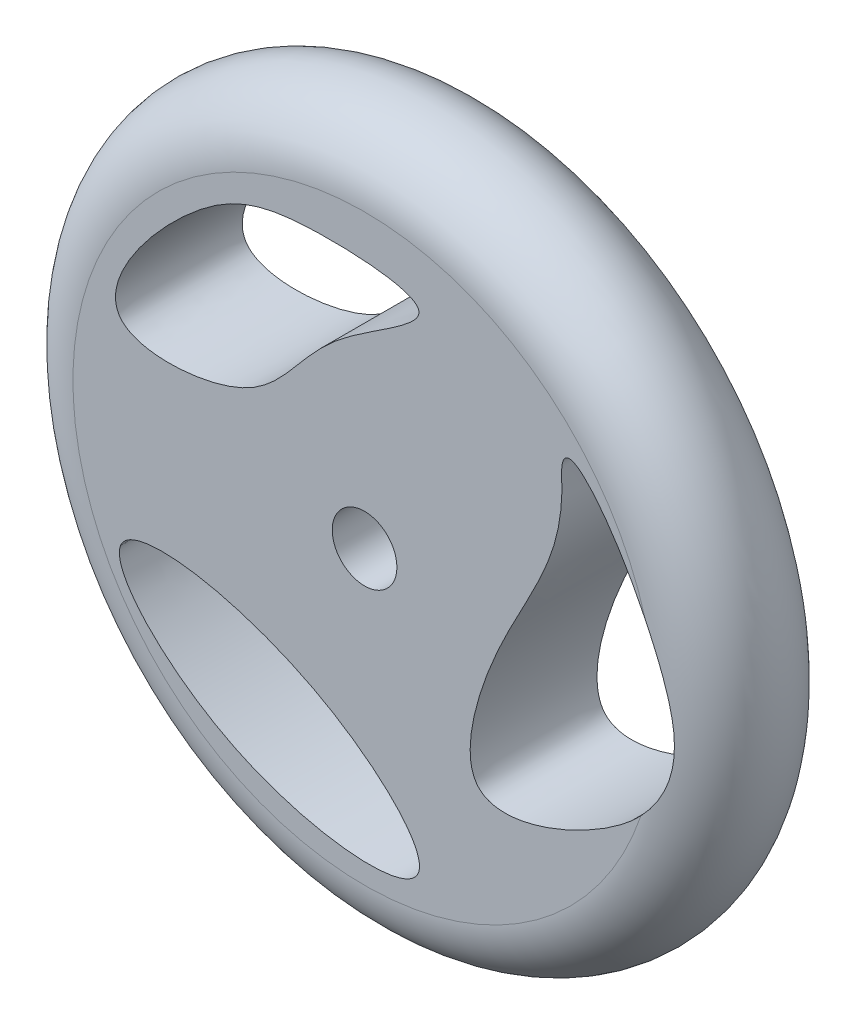
ISO-10303-21;
HEADER;
FILE_DESCRIPTION(('STEP AP214'),'2;1');
FILE_NAME('part.step','',(''),(''),'','','');
FILE_SCHEMA(('AUTOMOTIVE_DESIGN { 1 0 10303 214 1 1 1 1 }'));
ENDSEC;
DATA;
#1=APPLICATION_CONTEXT('core data for automotive mechanical design processes');
#2=APPLICATION_PROTOCOL_DEFINITION('international standard','automotive_design',2000,#1);
#3=PRODUCT_CONTEXT('',#1,'mechanical');
#4=PRODUCT('Part','Part','',(#3));
#5=PRODUCT_RELATED_PRODUCT_CATEGORY('part','',(#4));
#6=PRODUCT_DEFINITION_FORMATION('','',#4);
#7=PRODUCT_DEFINITION_CONTEXT('part definition',#1,'design');
#8=PRODUCT_DEFINITION('design','',#6,#7);
#9=PRODUCT_DEFINITION_SHAPE('','',#8);
#10=(LENGTH_UNIT() NAMED_UNIT(*) SI_UNIT(.MILLI.,.METRE.));
#11=(NAMED_UNIT(*) PLANE_ANGLE_UNIT() SI_UNIT($,.RADIAN.));
#12=(NAMED_UNIT(*) SI_UNIT($,.STERADIAN.) SOLID_ANGLE_UNIT());
#13=UNCERTAINTY_MEASURE_WITH_UNIT(LENGTH_MEASURE(1.E-05),#10,'distance_accuracy_value','');
#14=(GEOMETRIC_REPRESENTATION_CONTEXT(3) GLOBAL_UNCERTAINTY_ASSIGNED_CONTEXT((#13)) GLOBAL_UNIT_ASSIGNED_CONTEXT((#10,
#11,#12)) REPRESENTATION_CONTEXT('',''));
#15=CARTESIAN_POINT('',(0.,0.,0.));
#16=DIRECTION('',(0.,0.,1.));
#17=DIRECTION('',(1.,0.,0.));
#18=AXIS2_PLACEMENT_3D('',#15,#16,#17);
#19=CARTESIAN_POINT('',(3.86539948925941,-1.81251552572247,4.9999276254275));
#20=DIRECTION('',(0.,0.,1.));
#21=DIRECTION('',(1.,0.,0.));
#22=AXIS2_PLACEMENT_3D('',#19,#20,#21);
#23=TOROIDAL_SURFACE('',#22,161.000000001245,34.9999999987552);
#24=CARTESIAN_POINT('',(3.86539948925941,-1.81251552572247,39.9999276254275));
#25=DIRECTION('',(0.,0.,1.));
#26=DIRECTION('',(1.,0.,0.));
#27=AXIS2_PLACEMENT_3D('',#24,#25,#26);
#28=CIRCLE('',#27,161.000000001245);
#29=CARTESIAN_POINT('',(158.874474246453,41.6982503066501,39.9999276254275));
#30=VERTEX_POINT('',#29);
#31=CARTESIAN_POINT('',(156.408172834943,-53.3072124266898,39.9999276254275));
#32=VERTEX_POINT('',#31);
#33=EDGE_CURVE('E68',#30,#32,#28,.T.);
#34=ORIENTED_EDGE('',*,*,#33,.F.);
#35=CARTESIAN_POINT('',(156.408172834945,-53.3072124266879,39.9999276241824));
#36=CARTESIAN_POINT('',(156.921876116708,-52.772105150878,39.9998815728929));
#37=CARTESIAN_POINT('',(157.428051116455,-52.2297071347075,39.9955514237143));
#38=CARTESIAN_POINT('',(158.448183416138,-51.1034928340153,39.9789103164179));
#39=CARTESIAN_POINT('',(158.961325898859,-50.5189440556682,39.9662221804338));
#40=CARTESIAN_POINT('',(159.857286835496,-49.4639089030657,39.9372220647798));
#41=CARTESIAN_POINT('',(160.243935019851,-48.9966291469807,39.9223219629525));
#42=CARTESIAN_POINT('',(161.189180081013,-47.8228688985841,39.8802677518835));
#43=CARTESIAN_POINT('',(161.74018611191,-47.1103305518257,39.8506757225986));
#44=CARTESIAN_POINT('',(162.752721745627,-45.7431914799528,39.7887201319939));
#45=CARTESIAN_POINT('',(163.217407794676,-45.0908974723249,39.7570249509324));
#46=CARTESIAN_POINT('',(163.91027029634,-44.0775751981764,39.7056840774502));
#47=CARTESIAN_POINT('',(164.147595763525,-43.7227164385731,39.6873199154683));
#48=CARTESIAN_POINT('',(164.494917188226,-43.1914306745479,39.6589696501828));
#49=CARTESIAN_POINT('',(164.607781858329,-43.016847406432,39.6495179963174));
#50=CARTESIAN_POINT('',(165.074732612897,-42.2863331461147,39.6097313391776));
#51=CARTESIAN_POINT('',(165.420642241501,-41.7252126497903,39.578599197141));
#52=CARTESIAN_POINT('',(166.408262367915,-40.0612288006815,39.4864665962304));
#53=CARTESIAN_POINT('',(167.02392248029,-38.9427015021474,39.424773634456));
#54=CARTESIAN_POINT('',(167.903396398891,-37.2086136961069,39.3311892405959));
#55=CARTESIAN_POINT('',(168.195200563405,-36.6070596719714,39.2990897676157));
#56=CARTESIAN_POINT('',(168.806265446078,-35.287521388121,39.2306069614885));
#57=CARTESIAN_POINT('',(169.121386990219,-34.5675939700735,39.1944577037087));
#58=CARTESIAN_POINT('',(169.674984036269,-33.2256129069871,39.1298515915966));
#59=CARTESIAN_POINT('',(169.917821207482,-32.6053657275216,39.1010620518445));
#60=CARTESIAN_POINT('',(170.431279603557,-31.220367022957,39.0404676356368));
#61=CARTESIAN_POINT('',(170.696441725044,-30.453550586871,39.0093706096414));
#62=CARTESIAN_POINT('',(171.187096414704,-28.9263650129129,38.9524686645059));
#63=CARTESIAN_POINT('',(171.413352847249,-28.1662446551384,38.9265596384002));
#64=CARTESIAN_POINT('',(171.828690208897,-26.6534333924182,38.88005361722));
#65=CARTESIAN_POINT('',(172.018469213827,-25.9009372536605,38.859353871362));
#66=CARTESIAN_POINT('',(172.363298906031,-24.4044059975745,38.8232598473747));
#67=CARTESIAN_POINT('',(172.518989934208,-23.6605205342699,38.8077641548422));
#68=CARTESIAN_POINT('',(172.79805962295,-22.1822175591192,38.7820728879682));
#69=CARTESIAN_POINT('',(172.922028938199,-21.447913497692,38.7717763094804));
#70=CARTESIAN_POINT('',(173.086343690432,-20.3488945269526,38.760263100916));
#71=CARTESIAN_POINT('',(173.137198925463,-19.9857399331525,38.7570903532279));
#72=CARTESIAN_POINT('',(173.231033379891,-19.267962836767,38.75207889145));
#73=CARTESIAN_POINT('',(173.274182369222,-18.9133627556676,38.7502077775554));
#74=CARTESIAN_POINT('',(173.396120603405,-17.832249781734,38.7462301861714));
#75=CARTESIAN_POINT('',(173.464994360584,-17.1045894647329,38.7459237368831));
#76=CARTESIAN_POINT('',(173.579248330777,-15.6241844468407,38.7497037355316));
#77=CARTESIAN_POINT('',(173.623811746965,-14.8713779429923,38.7539301960771));
#78=CARTESIAN_POINT('',(173.68805474112,-13.3397055198722,38.7667650047298));
#79=CARTESIAN_POINT('',(173.706859004436,-12.56080424583,38.7755141805368));
#80=CARTESIAN_POINT('',(173.7181468177,-10.9759589061788,38.7974134280131));
#81=CARTESIAN_POINT('',(173.709698086902,-10.1700107283243,38.8107051690378));
#82=CARTESIAN_POINT('',(173.664998750498,-8.53002124022023,38.8416177821304));
#83=CARTESIAN_POINT('',(173.627761440293,-7.69600956012753,38.8593768781801));
#84=CARTESIAN_POINT('',(173.539380792001,-6.25096265807486,38.8935469588818));
#85=CARTESIAN_POINT('',(173.494553013406,-5.63950801174195,38.9090643499072));
#86=CARTESIAN_POINT('',(173.384983830164,-4.35047218823894,38.943508339595));
#87=CARTESIAN_POINT('',(173.318591389275,-3.6730358697127,38.9626221879639));
#88=CARTESIAN_POINT('',(173.161329616117,-2.24925009163031,39.0042445005321));
#89=CARTESIAN_POINT('',(173.068625850651,-1.50310811539775,39.0268988818242));
#90=CARTESIAN_POINT('',(172.853726499356,0.061197349477765,39.0756566254932));
#91=CARTESIAN_POINT('',(172.729505458499,0.879078100411061,39.1018780121728));
#92=CARTESIAN_POINT('',(172.446086649115,2.59031976383501,39.1577687787056));
#93=CARTESIAN_POINT('',(172.284665327437,3.48330982023481,39.1875259561231));
#94=CARTESIAN_POINT('',(172.018051658048,4.85032573781515,39.233769264293));
#95=CARTESIAN_POINT('',(171.921614771513,5.32608927221667,39.2499923994673));
#96=CARTESIAN_POINT('',(171.743937421341,6.17166409069229,39.2788864047869));
#97=CARTESIAN_POINT('',(171.664022269767,6.54175419546289,39.2915534444904));
#98=CARTESIAN_POINT('',(171.415792026679,7.66192695228776,39.3297924165164));
#99=CARTESIAN_POINT('',(171.24123391003,8.41063824874714,39.3552132665044));
#100=CARTESIAN_POINT('',(170.872854218629,9.91961516742336,39.4062259954886));
#101=CARTESIAN_POINT('',(170.678710688089,10.6798023532587,39.4318106677064));
#102=CARTESIAN_POINT('',(170.425883952789,11.6299364652754,39.4637233430421));
#103=CARTESIAN_POINT('',(170.374310719883,11.8217896066902,39.4701638949765));
#104=CARTESIAN_POINT('',(170.176206389314,12.5514488008447,39.4945097142226));
#105=CARTESIAN_POINT('',(170.026372946433,13.0883726031152,39.5121163061784));
#106=CARTESIAN_POINT('',(169.661568256196,14.3623602884828,39.5529196194209));
#107=CARTESIAN_POINT('',(169.443349152317,15.0985071278501,39.5757192569246));
#108=CARTESIAN_POINT('',(168.985440167471,16.5947123944453,39.6208094916051));
#109=CARTESIAN_POINT('',(168.745249903326,17.3546190609413,39.6430480043548));
#110=CARTESIAN_POINT('',(168.250740533113,18.873391119146,39.6859122915022));
#111=CARTESIAN_POINT('',(167.99636637702,19.6322387659273,39.7065309081569));
#112=CARTESIAN_POINT('',(167.478966955406,21.1359417609088,39.7454491783647));
#113=CARTESIAN_POINT('',(167.21609821618,21.8808503572873,39.7637756189245));
#114=CARTESIAN_POINT('',(166.683859303372,23.3547892301995,39.798195897308));
#115=CARTESIAN_POINT('',(166.414662841536,24.0838815699309,39.8143210282924));
#116=CARTESIAN_POINT('',(165.87175990787,25.5245290446633,39.8443076138371));
#117=CARTESIAN_POINT('',(165.598237981788,26.2361530212584,39.858206444164));
#118=CARTESIAN_POINT('',(165.048513684536,27.6404134156798,39.8837444594117));
#119=CARTESIAN_POINT('',(164.772501983121,28.3331237061303,39.8954265527215));
#120=CARTESIAN_POINT('',(164.355105157233,29.36349108114,39.9113399953377));
#121=CARTESIAN_POINT('',(164.216723581917,29.7023565044547,39.916336585537));
#122=CARTESIAN_POINT('',(163.936548904595,30.3831073018021,39.9258945913766));
#123=CARTESIAN_POINT('',(163.794734964983,30.7249841773223,39.9304505285306));
#124=CARTESIAN_POINT('',(163.362380317507,31.7593726647133,39.9435396749));
#125=CARTESIAN_POINT('',(163.068959155038,32.4506917600121,39.951341447188));
#126=CARTESIAN_POINT('',(162.469435355799,33.8428915696967,39.9652407328302));
#127=CARTESIAN_POINT('',(162.163198808156,34.5437148964942,39.9713043383712));
#128=CARTESIAN_POINT('',(161.538266672285,35.9541714021631,39.9817271521001));
#129=CARTESIAN_POINT('',(161.219447550409,36.6637500668057,39.9860554124222));
#130=CARTESIAN_POINT('',(160.569607873414,38.0909132453327,39.9930046371032));
#131=CARTESIAN_POINT('',(160.238474003701,38.8084462761002,39.9955974389942));
#132=CARTESIAN_POINT('',(159.564282111781,40.2506599243126,39.9990704750696));
#133=CARTESIAN_POINT('',(159.221120630899,40.9752922486122,39.9999251921755));
#134=CARTESIAN_POINT('',(158.874474246453,41.6982503066501,39.9999276241828));
#135=B_SPLINE_CURVE_WITH_KNOTS('',3,(#35,#36,#37,#38,#39,#40,#41,#42,#43,#44,#45,#46,#47,#48,
#49,#50,#51,#52,#53,#54,#55,#56,#57,#58,#59,#60,#61,#62,#63,#64,#65,#66,#67,#68,#69,#70,#71,#72,
#73,#74,#75,#76,#77,#78,#79,#80,#81,#82,#83,#84,#85,#86,#87,#88,#89,#90,#91,#92,#93,#94,#95,#96,
#97,#98,#99,#100,#101,#102,#103,#104,#105,#106,#107,#108,#109,#110,#111,#112,#113,#114,#115,
#116,#117,#118,#119,#120,#121,#122,#123,#124,#125,#126,#127,#128,#129,#130,#131,#132,#133,#134),
.UNSPECIFIED.,.F.,.F.,(4,2,2,2,2,2,2,2,2,2,2,2,2,2,2,2,2,2,2,2,2,2,2,2,2,2,2,2,2,2,2,2,2,2,2,2,
2,2,2,2,2,2,2,2,2,2,2,2,2,4),(0.,2.2253221832916,4.55865909227097,6.3785284676527,
9.08136271173561,11.485301648373,12.7671119324741,13.3914129107683,15.3708448643697,
19.2022930419531,21.210058938576,23.5693872754534,25.5691235596898,28.0041726558235,
30.383946058008,32.7122601388537,34.9921367932043,37.2258308409099,38.3259120224605,
39.397523064813,41.5897487763685,43.8516915299273,46.1887349782167,48.6065616413705,
51.1111443713795,52.9508613965804,54.9934885801501,57.2498827724123,59.7326002747364,
62.4560515641962,63.9131383583899,65.0496136466874,67.3570598248472,69.7118873931863,
70.3081920971222,71.981282337096,74.2855964944064,76.6772875854577,79.0790130856369,
81.4493475852283,83.7813772339117,86.0688337543457,88.3060727498491,89.4042653600976,
90.5147130663053,92.7678190367256,95.0622781371992,97.3960080264213,99.7667458426548,
102.172044605087),.UNSPECIFIED.);
#136=EDGE_CURVE('E50',#32,#30,#135,.T.);
#137=ORIENTED_EDGE('',*,*,#136,.F.);
#138=EDGE_LOOP('',(#34,#137));
#139=FACE_BOUND('',#138,.T.);
#140=CARTESIAN_POINT('',(3.86539948925941,-1.81251552572247,-30.0000723745725));
#141=DIRECTION('',(0.,0.,1.));
#142=DIRECTION('',(1.,0.,0.));
#143=AXIS2_PLACEMENT_3D('',#140,#141,#142);
#144=CIRCLE('',#143,161.000000001245);
#145=CARTESIAN_POINT('',(156.408171792705,-53.3072135123734,-30.0000723745725));
#146=VERTEX_POINT('',#145);
#147=CARTESIAN_POINT('',(158.874474246453,41.6982503066503,-30.0000723745725));
#148=VERTEX_POINT('',#147);
#149=EDGE_CURVE('E11',#146,#148,#144,.F.);
#150=ORIENTED_EDGE('',*,*,#149,.F.);
#151=CARTESIAN_POINT('',(158.874474246453,41.6982503066503,-30.0000723733277));
#152=CARTESIAN_POINT('',(159.167744117605,41.086622036072,-30.0000729067234));
#153=CARTESIAN_POINT('',(159.458513229089,40.4737975430752,-29.9994849302504));
#154=CARTESIAN_POINT('',(160.034892959705,39.245724904329,-29.997051245605));
#155=CARTESIAN_POINT('',(160.320503542041,38.6304767413295,-29.9952055284647));
#156=CARTESIAN_POINT('',(161.171270037953,36.776892473534,-29.9876436939386));
#157=CARTESIAN_POINT('',(161.728374374369,35.5348540063393,-29.9799017671769));
#158=CARTESIAN_POINT('',(162.820721576116,33.0378491914215,-29.9584535723443));
#159=CARTESIAN_POINT('',(163.355911356524,31.7828597224052,-29.9447336620914));
#160=CARTESIAN_POINT('',(164.401546872063,29.2607920473592,-29.9109289489668));
#161=CARTESIAN_POINT('',(164.911959885354,27.9937003653161,-29.8908359796796));
#162=CARTESIAN_POINT('',(165.904674940647,25.4480341674326,-29.8441533694861));
#163=CARTESIAN_POINT('',(166.386965507257,24.1694552064133,-29.8175610991953));
#164=CARTESIAN_POINT('',(167.093519771307,22.2231314410293,-29.7725419781576));
#165=CARTESIAN_POINT('',(167.329575001753,21.5595998708889,-29.7564020547668));
#166=CARTESIAN_POINT('',(167.792524023439,20.2293826734892,-29.722558127621));
#167=CARTESIAN_POINT('',(168.019417823102,19.562697049131,-29.7048541253043));
#168=CARTESIAN_POINT('',(168.463128699516,18.2265463171002,-29.6680274953101));
#169=CARTESIAN_POINT('',(168.679952895674,17.5570835492831,-29.6489058955233));
#170=CARTESIAN_POINT('',(169.103005401457,16.214861840873,-29.6093930001567));
#171=CARTESIAN_POINT('',(169.309233703707,15.5421028979862,-29.589001703693));
#172=CARTESIAN_POINT('',(169.910830165201,13.5201233595691,-29.5261978608781));
#173=CARTESIAN_POINT('',(170.289531928513,12.1659357926763,-29.4821199147761));
#174=CARTESIAN_POINT('',(170.997020489869,9.44576653238687,-29.391260489453));
#175=CARTESIAN_POINT('',(171.325845519752,8.07979472951321,-29.3444811193136));
#176=CARTESIAN_POINT('',(171.928157312816,5.33592219482689,-29.2504117781978));
#177=CARTESIAN_POINT('',(172.201656848136,3.95802429297638,-29.2031219277295));
#178=CARTESIAN_POINT('',(172.599541540842,1.69007251485088,-29.1273959948916));
#179=CARTESIAN_POINT('',(172.742139339805,0.80321255511008,-29.098308620378));
#180=CARTESIAN_POINT('',(173.000371658067,-0.974637027021778,-29.0418374283889));
#181=CARTESIAN_POINT('',(173.116002371816,-1.86562721419202,-29.0144538517497));
#182=CARTESIAN_POINT('',(173.31841460875,-3.65098697558652,-28.9622505393796));
#183=CARTESIAN_POINT('',(173.40519559245,-4.54535661268975,-28.9374308515988));
#184=CARTESIAN_POINT('',(173.547995462912,-6.33674993525229,-28.8912452972092));
#185=CARTESIAN_POINT('',(173.604011316705,-7.23377387362379,-28.8698797712739));
#186=CARTESIAN_POINT('',(173.682987352255,-9.02169712000073,-28.8316639865596));
#187=CARTESIAN_POINT('',(173.706226373929,-9.91258313016414,-28.8147766441937));
#188=CARTESIAN_POINT('',(173.718676259891,-11.6947395718201,-28.7861138304832));
#189=CARTESIAN_POINT('',(173.707885662297,-12.586010018183,-28.774338578774));
#190=CARTESIAN_POINT('',(173.650483710835,-14.3674044583804,-28.7566545393434));
#191=CARTESIAN_POINT('',(173.60387524939,-15.2575285389744,-28.7507452780103));
#192=CARTESIAN_POINT('',(173.473185483146,-17.0351229466359,-28.7454100246885));
#193=CARTESIAN_POINT('',(173.389102371752,-17.922593143687,-28.745984345296));
#194=CARTESIAN_POINT('',(173.201554243452,-19.526120541662,-28.7532785335743));
#195=CARTESIAN_POINT('',(173.104727510947,-20.2429644349978,-28.7588199158211));
#196=CARTESIAN_POINT('',(172.884819328393,-21.6726818161198,-28.7745566553692));
#197=CARTESIAN_POINT('',(172.761734207971,-22.3855547345384,-28.7847526635171));
#198=CARTESIAN_POINT('',(172.488844259983,-23.8060920978294,-28.809784295443));
#199=CARTESIAN_POINT('',(172.339039402856,-24.5137565369387,-28.8246199243539));
#200=CARTESIAN_POINT('',(172.012417129282,-25.922689835339,-28.8587776051414));
#201=CARTESIAN_POINT('',(171.835600840163,-26.6239589602459,-28.8780994698016));
#202=CARTESIAN_POINT('',(171.454844683086,-28.0189519410515,-28.9209326744792));
#203=CARTESIAN_POINT('',(171.25090541634,-28.7126759638272,-28.9444439216382));
#204=CARTESIAN_POINT('',(170.815084023753,-30.0943203678508,-28.995318739468));
#205=CARTESIAN_POINT('',(170.583089418969,-30.782204703805,-29.0226978963188));
#206=CARTESIAN_POINT('',(170.092102924389,-32.1482007540058,-29.0806454967928));
#207=CARTESIAN_POINT('',(169.833108666807,-32.8263116052023,-29.1112142201314));
#208=CARTESIAN_POINT('',(169.288617472373,-34.1717040523992,-29.1748165304147));
#209=CARTESIAN_POINT('',(169.003119992971,-34.8389854263796,-29.2078501678162));
#210=CARTESIAN_POINT('',(168.406314749348,-36.1617501407495,-29.2755416609585));
#211=CARTESIAN_POINT('',(168.09500902086,-36.8172344067303,-29.3101993884989));
#212=CARTESIAN_POINT('',(167.447466161486,-38.1155295393192,-29.3802036013341));
#213=CARTESIAN_POINT('',(167.111235174634,-38.7583434800113,-29.4155499153204));
#214=CARTESIAN_POINT('',(166.460524134429,-39.9471669239166,-29.4813137247474));
#215=CARTESIAN_POINT('',(166.148995318491,-40.494793442237,-29.5117683196863));
#216=CARTESIAN_POINT('',(165.508539638417,-41.5797264099853,-29.571765240694));
#217=CARTESIAN_POINT('',(165.179615139965,-42.1170342491984,-29.6013076899467));
#218=CARTESIAN_POINT('',(164.505062490691,-43.1811620695592,-29.6587918209272));
#219=CARTESIAN_POINT('',(164.159433864593,-43.7079817516887,-29.6867334570582));
#220=CARTESIAN_POINT('',(163.452213527711,-44.7510043686882,-29.740322672132));
#221=CARTESIAN_POINT('',(163.090619837028,-45.2672059750626,-29.7659699653431));
#222=CARTESIAN_POINT('',(162.352255385273,-46.2888914374865,-29.8142818241146));
#223=CARTESIAN_POINT('',(161.975482377286,-46.7943736897773,-29.8369459459571));
#224=CARTESIAN_POINT('',(161.20895733186,-47.7927604478416,-29.878542172542));
#225=CARTESIAN_POINT('',(160.819254888023,-48.285702523381,-29.8974869589993));
#226=CARTESIAN_POINT('',(160.026458551868,-49.2608197690425,-29.9310988962333));
#227=CARTESIAN_POINT('',(159.623365003983,-49.7429952155614,-29.9457661569378));
#228=CARTESIAN_POINT('',(158.804663035176,-50.6965635914377,-29.9702074366446));
#229=CARTESIAN_POINT('',(158.389057014064,-51.1679585582849,-29.9799823877006));
#230=CARTESIAN_POINT('',(157.546232567847,-52.0999693124885,-29.9940563676091));
#231=CARTESIAN_POINT('',(157.11901905568,-52.5605895113118,-29.9983576774419));
#232=CARTESIAN_POINT('',(156.253898909363,-53.4710797755668,-30.000952670638));
#233=CARTESIAN_POINT('',(155.816000007053,-53.9209571737779,-29.9992505770656));
#234=CARTESIAN_POINT('',(155.372999704671,-54.3656999350251,-29.9942807735201));
#235=B_SPLINE_CURVE_WITH_KNOTS('',3,(#151,#152,#153,#154,#155,#156,#157,#158,#159,#160,#161,
#162,#163,#164,#165,#166,#167,#168,#169,#170,#171,#172,#173,#174,#175,#176,#177,#178,#179,#180,
#181,#182,#183,#184,#185,#186,#187,#188,#189,#190,#191,#192,#193,#194,#195,#196,#197,#198,#199,
#200,#201,#202,#203,#204,#205,#206,#207,#208,#209,#210,#211,#212,#213,#214,#215,#216,#217,#218,
#219,#220,#221,#222,#223,#224,#225,#226,#227,#228,#229,#230,#231,#232,#233,#234),.UNSPECIFIED.,
.F.,.F.,(4,2,2,2,2,2,2,2,2,2,2,2,2,2,2,2,2,2,2,2,2,2,2,2,2,2,2,2,2,2,2,2,2,2,2,2,2,2,2,2,2,4),
(0.,2.03490016590018,4.06981484107365,8.15341085752634,12.2463751421687,16.3446054708146,
20.4444965493206,22.5578047912986,24.6711110898852,26.7828997552426,28.8946898905466,
33.1142720704773,37.3306033032135,41.5459600632783,44.2417663207634,46.9379527761625,
49.6341896470233,52.3306922776493,55.0041138666631,57.6776503049834,60.3509708682197,
63.0244203221046,65.1940746145344,67.3640323780443,69.5339925422299,71.7038621674415,
73.8736837030772,76.0525123474846,78.2315322293983,80.4105967281101,82.5894895072977,
84.7678469677402,86.6598388159523,88.5515740257649,90.4433630920882,92.3353874300294,
94.2276928709659,96.113429623581,97.9991179105159,99.884446810409,101.768989796888,
103.652207375443),.UNSPECIFIED.);
#236=EDGE_CURVE('E73',#148,#146,#235,.T.);
#237=ORIENTED_EDGE('',*,*,#236,.F.);
#238=EDGE_LOOP('',(#150,#237));
#239=FACE_BOUND('',#238,.T.);
#240=ADVANCED_FACE('F40',(#139,#239),#23,.T.);
#241=CARTESIAN_POINT('',(3.86539948925941,-1.81251552572247,39.9999276254275));
#242=DIRECTION('',(0.,0.,1.));
#243=DIRECTION('',(1.,0.,0.));
#244=AXIS2_PLACEMENT_3D('',#241,#242,#243);
#245=PLANE('',#244);
#246=CARTESIAN_POINT('',(112.754288378148,91.4235955853886,39.9999276254275));
#247=CARTESIAN_POINT('',(112.53850045505,88.7992476549795,39.9999276254275));
#248=CARTESIAN_POINT('',(115.069490434201,42.4622170099334,39.9999276254275));
#249=CARTESIAN_POINT('',(76.2058909821558,4.00497008912455,39.9999276254275));
#250=CARTESIAN_POINT('',(49.7647088668075,-107.290397524142,39.9999276254275));
#251=CARTESIAN_POINT('',(158.373973476424,-68.1478916769024,39.9999276254275));
#252=CARTESIAN_POINT('',(194.838396815586,2.62623894105603,39.9999276254275));
#253=CARTESIAN_POINT('',(114.844384921133,116.842722189749,39.9999276254275));
#254=CARTESIAN_POINT('',(112.754288378148,91.4235955853886,39.9999276254275));
#255=B_SPLINE_CURVE_WITH_KNOTS('',3,(#246,#247,#248,#249,#250,#251,#252,#253,#254),
.UNSPECIFIED.,.T.,.F.,(4,1,1,1,1,1,4),(0.,0.0216380913829987,0.285746568265664,
0.416162579058461,0.584140667228523,0.790415981826227,1.),.UNSPECIFIED.);
#256=EDGE_CURVE('E77',#30,#32,#255,.T.);
#257=ORIENTED_EDGE('',*,*,#256,.F.);
#258=ORIENTED_EDGE('',*,*,#33,.T.);
#259=EDGE_LOOP('',(#257,#258));
#260=FACE_BOUND('',#259,.T.);
#261=CARTESIAN_POINT('',(3.86539948925941,-1.81251552572247,39.9999276254275));
#262=DIRECTION('',(0.,0.,1.));
#263=DIRECTION('',(1.,0.,0.));
#264=AXIS2_PLACEMENT_3D('',#261,#262,#263);
#265=CIRCLE('',#264,17.85);
#266=CARTESIAN_POINT('',(21.7153994892594,-1.81251552572247,39.9999276254275));
#267=VERTEX_POINT('',#266);
#268=EDGE_CURVE('E78',#267,#267,#265,.T.);
#269=ORIENTED_EDGE('',*,*,#268,.F.);
#270=EDGE_LOOP('',(#269));
#271=FACE_BOUND('',#270,.T.);
#272=CARTESIAN_POINT('',(-130.884600510741,41.0624844742776,39.9999276254275));
#273=CARTESIAN_POINT('',(-121.379636816311,29.1921572460387,39.9999276254275));
#274=CARTESIAN_POINT('',(-46.2988801822641,33.5052213983875,39.9999276254275));
#275=CARTESIAN_POINT('',(-28.0680280203324,88.1037615767087,39.9999276254275));
#276=CARTESIAN_POINT('',(62.9478600755335,132.46262523029,39.9999276254275));
#277=CARTESIAN_POINT('',(-36.4608489310949,139.597239581589,39.9999276254275));
#278=CARTESIAN_POINT('',(-87.8624580344655,124.964352714437,39.9999276254275));
#279=CARTESIAN_POINT('',(-143.060540339782,56.2684752311669,39.9999276254275));
#280=CARTESIAN_POINT('',(-130.884600510741,41.0624844742776,39.9999276254275));
#281=B_SPLINE_CURVE_WITH_KNOTS('',3,(#272,#273,#274,#275,#276,#277,#278,#279,#280),
.UNSPECIFIED.,.T.,.F.,(4,1,1,1,1,1,4),(0.,0.163508441219118,0.345331599429699,0.482915798169805,
0.621708666089882,0.79054428761353,1.),.UNSPECIFIED.);
#282=CARTESIAN_POINT('',(-130.884600510741,41.0624844742776,39.9999276254275));
#283=VERTEX_POINT('',#282);
#284=EDGE_CURVE('E86',#283,#283,#281,.T.);
#285=ORIENTED_EDGE('',*,*,#284,.F.);
#286=EDGE_LOOP('',(#285));
#287=FACE_BOUND('',#286,.T.);
#288=CARTESIAN_POINT('',(-130.884600510741,-67.8264044146113,39.9999276254275));
#289=CARTESIAN_POINT('',(-136.325784419563,-82.3802023344931,39.9999276254275));
#290=CARTESIAN_POINT('',(-71.3630989792993,-150.63935391536,39.9999276254275));
#291=CARTESIAN_POINT('',(70.6406989859963,-160.353999952646,39.9999276254275));
#292=CARTESIAN_POINT('',(-25.949327026307,-65.9208183336305,39.9999276254275));
#293=CARTESIAN_POINT('',(-124.532695826271,-50.8366575629681,39.9999276254275));
#294=CARTESIAN_POINT('',(-130.884600510741,-67.8264044146113,39.9999276254275));
#295=B_SPLINE_CURVE_WITH_KNOTS('',3,(#288,#289,#290,#291,#292,#293,#294),.UNSPECIFIED.,.T.,.F.,
(4,1,1,1,4),(0.,0.246554882695462,0.503345829427122,0.712177875143499,1.),.UNSPECIFIED.);
#296=CARTESIAN_POINT('',(-130.884600510741,-67.8264044146113,39.9999276254275));
#297=VERTEX_POINT('',#296);
#298=EDGE_CURVE('E88',#297,#297,#295,.T.);
#299=ORIENTED_EDGE('',*,*,#298,.F.);
#300=EDGE_LOOP('',(#299));
#301=FACE_BOUND('',#300,.T.);
#302=ADVANCED_FACE('F75',(#260,#271,#287,#301),#245,.T.);
#303=CARTESIAN_POINT('',(3.86539948925941,-1.81251552572247,-30.0000723745725));
#304=DIRECTION('',(0.,0.,1.));
#305=DIRECTION('',(1.,0.,0.));
#306=AXIS2_PLACEMENT_3D('',#303,#304,#305);
#307=PLANE('',#306);
#308=CARTESIAN_POINT('',(3.86539948925941,-1.81251552572247,-30.0000723745725));
#309=DIRECTION('',(0.,0.,1.));
#310=DIRECTION('',(1.,0.,0.));
#311=AXIS2_PLACEMENT_3D('',#308,#309,#310);
#312=CIRCLE('',#311,17.85);
#313=CARTESIAN_POINT('',(21.7153994892594,-1.81251552572247,-30.0000723745725));
#314=VERTEX_POINT('',#313);
#315=EDGE_CURVE('E92',#314,#314,#312,.T.);
#316=ORIENTED_EDGE('',*,*,#315,.T.);
#317=EDGE_LOOP('',(#316));
#318=FACE_BOUND('',#317,.T.);
#319=CARTESIAN_POINT('',(-130.884600510741,41.0624844742776,-30.0000723745725));
#320=CARTESIAN_POINT('',(-121.379636816311,29.1921572460387,-30.0000723745725));
#321=CARTESIAN_POINT('',(-46.2988801822641,33.5052213983875,-30.0000723745725));
#322=CARTESIAN_POINT('',(-28.0680280203324,88.1037615767087,-30.0000723745725));
#323=CARTESIAN_POINT('',(62.9478600755335,132.46262523029,-30.0000723745725));
#324=CARTESIAN_POINT('',(-36.4608489310949,139.597239581589,-30.0000723745725));
#325=CARTESIAN_POINT('',(-87.8624580344655,124.964352714437,-30.0000723745725));
#326=CARTESIAN_POINT('',(-143.060540339782,56.2684752311669,-30.0000723745725));
#327=CARTESIAN_POINT('',(-130.884600510741,41.0624844742776,-30.0000723745725));
#328=B_SPLINE_CURVE_WITH_KNOTS('',3,(#319,#320,#321,#322,#323,#324,#325,#326,#327),
.UNSPECIFIED.,.T.,.F.,(4,1,1,1,1,1,4),(0.,0.163508441219118,0.345331599429699,0.482915798169805,
0.621708666089882,0.79054428761353,1.),.UNSPECIFIED.);
#329=CARTESIAN_POINT('',(-130.884600510741,41.0624844742776,-30.0000723745725));
#330=VERTEX_POINT('',#329);
#331=EDGE_CURVE('E82',#330,#330,#328,.T.);
#332=ORIENTED_EDGE('',*,*,#331,.T.);
#333=EDGE_LOOP('',(#332));
#334=FACE_BOUND('',#333,.T.);
#335=CARTESIAN_POINT('',(112.754288378148,91.4235955853886,-30.0000723745725));
#336=CARTESIAN_POINT('',(112.53850045505,88.7992476549795,-30.0000723745725));
#337=CARTESIAN_POINT('',(115.069490434201,42.4622170099334,-30.0000723745725));
#338=CARTESIAN_POINT('',(76.2058909821558,4.00497008912455,-30.0000723745725));
#339=CARTESIAN_POINT('',(49.7647088668075,-107.290397524142,-30.0000723745725));
#340=CARTESIAN_POINT('',(158.373973476424,-68.1478916769024,-30.0000723745725));
#341=CARTESIAN_POINT('',(194.838396815586,2.62623894105603,-30.0000723745725));
#342=CARTESIAN_POINT('',(114.844384921133,116.842722189749,-30.0000723745725));
#343=CARTESIAN_POINT('',(112.754288378148,91.4235955853886,-30.0000723745725));
#344=B_SPLINE_CURVE_WITH_KNOTS('',3,(#335,#336,#337,#338,#339,#340,#341,#342,#343),
.UNSPECIFIED.,.T.,.F.,(4,1,1,1,1,1,4),(0.,0.0216380913829987,0.285746568265664,
0.416162579058461,0.584140667228523,0.790415981826227,1.),.UNSPECIFIED.);
#345=EDGE_CURVE('E83',#148,#146,#344,.T.);
#346=ORIENTED_EDGE('',*,*,#345,.T.);
#347=ORIENTED_EDGE('',*,*,#149,.T.);
#348=EDGE_LOOP('',(#346,#347));
#349=FACE_BOUND('',#348,.T.);
#350=CARTESIAN_POINT('',(-130.884600510741,-67.8264044146113,-30.0000723745725));
#351=CARTESIAN_POINT('',(-136.325784419563,-82.3802023344931,-30.0000723745725));
#352=CARTESIAN_POINT('',(-71.3630989792993,-150.63935391536,-30.0000723745725));
#353=CARTESIAN_POINT('',(70.6406989859963,-160.353999952646,-30.0000723745725));
#354=CARTESIAN_POINT('',(-25.949327026307,-65.9208183336305,-30.0000723745725));
#355=CARTESIAN_POINT('',(-124.532695826271,-50.8366575629681,-30.0000723745725));
#356=CARTESIAN_POINT('',(-130.884600510741,-67.8264044146113,-30.0000723745725));
#357=B_SPLINE_CURVE_WITH_KNOTS('',3,(#350,#351,#352,#353,#354,#355,#356),.UNSPECIFIED.,.T.,.F.,
(4,1,1,1,4),(0.,0.246554882695462,0.503345829427122,0.712177875143499,1.),.UNSPECIFIED.);
#358=CARTESIAN_POINT('',(-130.884600510741,-67.8264044146113,-30.0000723745725));
#359=VERTEX_POINT('',#358);
#360=EDGE_CURVE('E99',#359,#359,#357,.T.);
#361=ORIENTED_EDGE('',*,*,#360,.T.);
#362=EDGE_LOOP('',(#361));
#363=FACE_BOUND('',#362,.T.);
#364=ADVANCED_FACE('F134',(#318,#334,#349,#363),#307,.F.);
#365=CARTESIAN_POINT('',(3.86539948925941,-1.81251552572247,39.9999276254275));
#366=DIRECTION('',(0.,0.,-1.));
#367=DIRECTION('',(-1.,0.,0.));
#368=AXIS2_PLACEMENT_3D('',#365,#366,#367);
#369=CYLINDRICAL_SURFACE('',#368,17.85);
#370=ORIENTED_EDGE('',*,*,#268,.T.);
#371=EDGE_LOOP('',(#370));
#372=FACE_BOUND('',#371,.T.);
#373=ORIENTED_EDGE('',*,*,#315,.F.);
#374=EDGE_LOOP('',(#373));
#375=FACE_BOUND('',#374,.T.);
#376=ADVANCED_FACE('F137',(#372,#375),#369,.F.);
#377=DIRECTION('',(0.,0.,-1.));
#378=VECTOR('',#377,1.);
#379=SURFACE_OF_LINEAR_EXTRUSION('',#281,#378);
#380=ORIENTED_EDGE('',*,*,#284,.T.);
#381=EDGE_LOOP('',(#380));
#382=FACE_BOUND('',#381,.T.);
#383=ORIENTED_EDGE('',*,*,#331,.F.);
#384=EDGE_LOOP('',(#383));
#385=FACE_BOUND('',#384,.T.);
#386=ADVANCED_FACE('F116',(#382,#385),#379,.T.);
#387=DIRECTION('',(0.,0.,-1.));
#388=VECTOR('',#387,1.);
#389=SURFACE_OF_LINEAR_EXTRUSION('',#255,#388);
#390=ORIENTED_EDGE('',*,*,#256,.T.);
#391=ORIENTED_EDGE('',*,*,#136,.T.);
#392=EDGE_LOOP('',(#390,#391));
#393=FACE_BOUND('',#392,.T.);
#394=ORIENTED_EDGE('',*,*,#345,.F.);
#395=ORIENTED_EDGE('',*,*,#236,.T.);
#396=EDGE_LOOP('',(#394,#395));
#397=FACE_BOUND('',#396,.T.);
#398=ADVANCED_FACE('F80',(#393,#397),#389,.T.);
#399=DIRECTION('',(0.,0.,-1.));
#400=VECTOR('',#399,1.);
#401=SURFACE_OF_LINEAR_EXTRUSION('',#295,#400);
#402=ORIENTED_EDGE('',*,*,#298,.T.);
#403=EDGE_LOOP('',(#402));
#404=FACE_BOUND('',#403,.T.);
#405=ORIENTED_EDGE('',*,*,#360,.F.);
#406=EDGE_LOOP('',(#405));
#407=FACE_BOUND('',#406,.T.);
#408=ADVANCED_FACE('F115',(#404,#407),#401,.T.);
#409=CLOSED_SHELL('',(#240,#302,#364,#376,#386,#398,#408));
#410=MANIFOLD_SOLID_BREP('B2',#409);
#411=ADVANCED_BREP_SHAPE_REPRESENTATION('',(#18,#410),#14);
#412=SHAPE_DEFINITION_REPRESENTATION(#9,#411);
ENDSEC;
END-ISO-10303-21;
